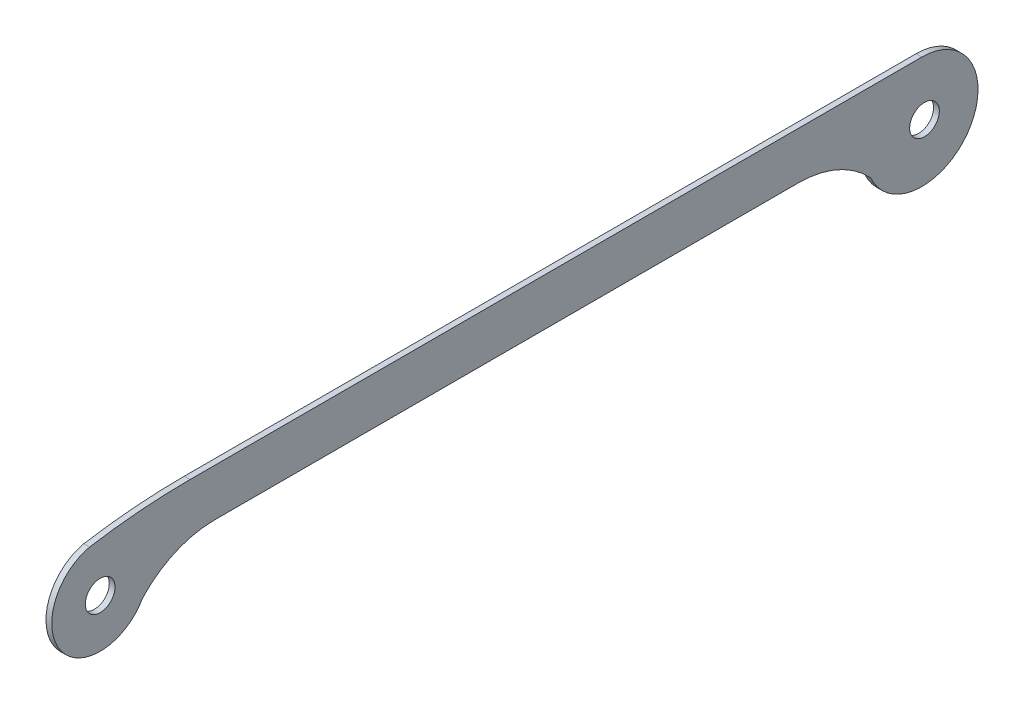
ISO-10303-21;
HEADER;
FILE_DESCRIPTION(('STEP AP214'),'2;1');
FILE_NAME('part.step','',(''),(''),'','','');
FILE_SCHEMA(('AUTOMOTIVE_DESIGN { 1 0 10303 214 1 1 1 1 }'));
ENDSEC;
DATA;
#1=APPLICATION_CONTEXT('core data for automotive mechanical design processes');
#2=APPLICATION_PROTOCOL_DEFINITION('international standard','automotive_design',2000,#1);
#3=PRODUCT_CONTEXT('',#1,'mechanical');
#4=PRODUCT('Part','Part','',(#3));
#5=PRODUCT_RELATED_PRODUCT_CATEGORY('part','',(#4));
#6=PRODUCT_DEFINITION_FORMATION('','',#4);
#7=PRODUCT_DEFINITION_CONTEXT('part definition',#1,'design');
#8=PRODUCT_DEFINITION('design','',#6,#7);
#9=PRODUCT_DEFINITION_SHAPE('','',#8);
#10=(LENGTH_UNIT() NAMED_UNIT(*) SI_UNIT(.MILLI.,.METRE.));
#11=(NAMED_UNIT(*) PLANE_ANGLE_UNIT() SI_UNIT($,.RADIAN.));
#12=(NAMED_UNIT(*) SI_UNIT($,.STERADIAN.) SOLID_ANGLE_UNIT());
#13=UNCERTAINTY_MEASURE_WITH_UNIT(LENGTH_MEASURE(1.E-05),#10,'distance_accuracy_value','');
#14=(GEOMETRIC_REPRESENTATION_CONTEXT(3) GLOBAL_UNCERTAINTY_ASSIGNED_CONTEXT((#13)) GLOBAL_UNIT_ASSIGNED_CONTEXT((#10,
#11,#12)) REPRESENTATION_CONTEXT('',''));
#15=CARTESIAN_POINT('',(0.,0.,0.));
#16=DIRECTION('',(0.,0.,1.));
#17=DIRECTION('',(1.,0.,0.));
#18=AXIS2_PLACEMENT_3D('',#15,#16,#17);
#19=CARTESIAN_POINT('',(1.5,-73.3691461799434,-93.7643002823865));
#20=DIRECTION('',(1.,0.,0.));
#21=DIRECTION('',(0.,0.,-1.));
#22=AXIS2_PLACEMENT_3D('',#19,#20,#21);
#23=PLANE('',#22);
#24=CARTESIAN_POINT('',(1.5,72.2487098482802,-70.4772250920268));
#25=DIRECTION('',(1.,0.,0.));
#26=DIRECTION('',(0.,0.,-1.));
#27=AXIS2_PLACEMENT_3D('',#24,#25,#26);
#28=CIRCLE('',#27,3.84999999998886);
#29=CARTESIAN_POINT('',(1.5,72.2487098482802,-74.3272250920156));
#30=VERTEX_POINT('',#29);
#31=EDGE_CURVE('E134',#30,#30,#28,.T.);
#32=ORIENTED_EDGE('',*,*,#31,.F.);
#33=EDGE_LOOP('',(#32));
#34=FACE_BOUND('',#33,.T.);
#35=CARTESIAN_POINT('',(1.5,-73.3691461799434,-93.7643002823865));
#36=DIRECTION('',(1.,0.,0.));
#37=DIRECTION('',(0.,0.,-1.));
#38=AXIS2_PLACEMENT_3D('',#35,#36,#37);
#39=CIRCLE('',#38,160.002122552873);
#40=CARTESIAN_POINT('',(1.5,86.6329763729295,-93.7643002823865));
#41=VERTEX_POINT('',#40);
#42=CARTESIAN_POINT('',(1.5,84.4987098480569,-67.7178177070529));
#43=VERTEX_POINT('',#42);
#44=EDGE_CURVE('E146',#41,#43,#39,.T.);
#45=ORIENTED_EDGE('',*,*,#44,.T.);
#46=CARTESIAN_POINT('',(1.5,72.2487098482802,-70.4772250920268));
#47=DIRECTION('',(1.,0.,0.));
#48=DIRECTION('',(0.,0.,-1.));
#49=AXIS2_PLACEMENT_3D('',#46,#47,#48);
#50=CIRCLE('',#49,12.556943462116);
#51=CARTESIAN_POINT('',(1.5,66.1602692163077,-81.459379697646));
#52=VERTEX_POINT('',#51);
#53=EDGE_CURVE('E90',#43,#52,#50,.T.);
#54=ORIENTED_EDGE('',*,*,#53,.T.);
#55=CARTESIAN_POINT('',(1.5,48.9111321560017,-100.201901365951));
#56=DIRECTION('',(-1.,0.,0.));
#57=DIRECTION('',(0.,0.,-1.));
#58=AXIS2_PLACEMENT_3D('',#55,#56,#57);
#59=CIRCLE('',#58,25.4718442169411);
#60=CARTESIAN_POINT('',(1.5,74.3829763729428,-100.201901365951));
#61=VERTEX_POINT('',#60);
#62=EDGE_CURVE('E161',#52,#61,#59,.T.);
#63=ORIENTED_EDGE('',*,*,#62,.T.);
#64=DIRECTION('',(0.,0.,-1.));
#65=VECTOR('',#64,1.);
#66=CARTESIAN_POINT('',(1.5,74.3829763729428,-251.501318296598));
#67=LINE('',#66,#65);
#68=CARTESIAN_POINT('',(1.5,74.3829763729428,-251.501318296598));
#69=VERTEX_POINT('',#68);
#70=EDGE_CURVE('E172',#61,#69,#67,.T.);
#71=ORIENTED_EDGE('',*,*,#70,.T.);
#72=CARTESIAN_POINT('',(1.5,48.9111321560017,-251.501318296598));
#73=DIRECTION('',(-1.,0.,0.));
#74=DIRECTION('',(0.,0.,1.));
#75=AXIS2_PLACEMENT_3D('',#72,#73,#74);
#76=CIRCLE('',#75,25.4718442169411);
#77=CARTESIAN_POINT('',(1.5,66.1602692163077,-270.243839964903));
#78=VERTEX_POINT('',#77);
#79=EDGE_CURVE('E110',#69,#78,#76,.T.);
#80=ORIENTED_EDGE('',*,*,#79,.T.);
#81=DIRECTION('',(0.,-0.735813296778874,-0.677184459570216));
#82=VECTOR('',#81,1.);
#83=CARTESIAN_POINT('',(1.5,66.1602692163077,-270.243839964903));
#84=LINE('',#83,#82);
#85=CARTESIAN_POINT('',(1.5,66.1381263311152,-270.264218528063));
#86=VERTEX_POINT('',#85);
#87=EDGE_CURVE('E103',#78,#86,#84,.T.);
#88=ORIENTED_EDGE('',*,*,#87,.T.);
#89=CARTESIAN_POINT('',(1.5,72.0776927066033,-283.55247777743));
#90=DIRECTION('',(1.,0.,0.));
#91=DIRECTION('',(0.,0.,1.));
#92=AXIS2_PLACEMENT_3D('',#89,#90,#91);
#93=CIRCLE('',#92,14.5552836663263);
#94=CARTESIAN_POINT('',(1.5,86.6329763729296,-283.55247777743));
#95=VERTEX_POINT('',#94);
#96=EDGE_CURVE('E107',#86,#95,#93,.T.);
#97=ORIENTED_EDGE('',*,*,#96,.T.);
#98=DIRECTION('',(0.,0.,1.));
#99=VECTOR('',#98,1.);
#100=CARTESIAN_POINT('',(1.5,86.6329763729296,-249.095497945172));
#101=LINE('',#100,#99);
#102=EDGE_CURVE('E49',#95,#41,#101,.T.);
#103=ORIENTED_EDGE('',*,*,#102,.T.);
#104=EDGE_LOOP('',(#45,#54,#63,#71,#80,#88,#97,#103));
#105=FACE_BOUND('',#104,.T.);
#106=CARTESIAN_POINT('',(1.5,72.2487098482802,-284.227225092027));
#107=DIRECTION('',(1.,0.,0.));
#108=DIRECTION('',(0.,0.,-1.));
#109=AXIS2_PLACEMENT_3D('',#106,#107,#108);
#110=CIRCLE('',#109,3.84999999998893);
#111=CARTESIAN_POINT('',(1.5,72.2487098482802,-288.077225092016));
#112=VERTEX_POINT('',#111);
#113=EDGE_CURVE('E181',#112,#112,#110,.T.);
#114=ORIENTED_EDGE('',*,*,#113,.F.);
#115=EDGE_LOOP('',(#114));
#116=FACE_BOUND('',#115,.T.);
#117=ADVANCED_FACE('F32',(#34,#105,#116),#23,.T.);
#118=CARTESIAN_POINT('',(0.,-73.3691461799434,-93.7643002823865));
#119=DIRECTION('',(1.,0.,0.));
#120=DIRECTION('',(0.,0.,-1.));
#121=AXIS2_PLACEMENT_3D('',#118,#119,#120);
#122=PLANE('',#121);
#123=CARTESIAN_POINT('',(0.,-73.3691461799434,-93.7643002823865));
#124=DIRECTION('',(1.,0.,0.));
#125=DIRECTION('',(0.,0.,-1.));
#126=AXIS2_PLACEMENT_3D('',#123,#124,#125);
#127=CIRCLE('',#126,160.002122552873);
#128=CARTESIAN_POINT('',(0.,86.6329763729295,-93.7643002823865));
#129=VERTEX_POINT('',#128);
#130=CARTESIAN_POINT('',(0.,84.4987098480569,-67.7178177070529));
#131=VERTEX_POINT('',#130);
#132=EDGE_CURVE('E130',#129,#131,#127,.T.);
#133=ORIENTED_EDGE('',*,*,#132,.F.);
#134=DIRECTION('',(0.,0.,1.));
#135=VECTOR('',#134,1.);
#136=CARTESIAN_POINT('',(0.,86.6329763729296,-249.095497945172));
#137=LINE('',#136,#135);
#138=CARTESIAN_POINT('',(0.,86.6329763729296,-283.55247777743));
#139=VERTEX_POINT('',#138);
#140=EDGE_CURVE('E78',#139,#129,#137,.T.);
#141=ORIENTED_EDGE('',*,*,#140,.F.);
#142=CARTESIAN_POINT('',(0.,72.0776927066033,-283.55247777743));
#143=DIRECTION('',(1.,0.,0.));
#144=DIRECTION('',(0.,0.,1.));
#145=AXIS2_PLACEMENT_3D('',#142,#143,#144);
#146=CIRCLE('',#145,14.5552836663263);
#147=CARTESIAN_POINT('',(0.,66.1381263311152,-270.264218528063));
#148=VERTEX_POINT('',#147);
#149=EDGE_CURVE('E143',#148,#139,#146,.T.);
#150=ORIENTED_EDGE('',*,*,#149,.F.);
#151=DIRECTION('',(0.,-0.735813296778874,-0.677184459570216));
#152=VECTOR('',#151,1.);
#153=CARTESIAN_POINT('',(0.,66.1602692163077,-270.243839964903));
#154=LINE('',#153,#152);
#155=CARTESIAN_POINT('',(0.,66.1602692163077,-270.243839964903));
#156=VERTEX_POINT('',#155);
#157=EDGE_CURVE('E119',#156,#148,#154,.T.);
#158=ORIENTED_EDGE('',*,*,#157,.F.);
#159=CARTESIAN_POINT('',(0.,48.9111321560017,-251.501318296598));
#160=DIRECTION('',(-1.,0.,0.));
#161=DIRECTION('',(0.,0.,1.));
#162=AXIS2_PLACEMENT_3D('',#159,#160,#161);
#163=CIRCLE('',#162,25.4718442169411);
#164=CARTESIAN_POINT('',(0.,74.3829763729428,-251.501318296598));
#165=VERTEX_POINT('',#164);
#166=EDGE_CURVE('E140',#165,#156,#163,.T.);
#167=ORIENTED_EDGE('',*,*,#166,.F.);
#168=DIRECTION('',(0.,0.,-1.));
#169=VECTOR('',#168,1.);
#170=CARTESIAN_POINT('',(0.,74.3829763729428,-251.501318296598));
#171=LINE('',#170,#169);
#172=CARTESIAN_POINT('',(0.,74.3829763729428,-100.201901365951));
#173=VERTEX_POINT('',#172);
#174=EDGE_CURVE('E138',#173,#165,#171,.T.);
#175=ORIENTED_EDGE('',*,*,#174,.F.);
#176=CARTESIAN_POINT('',(0.,48.9111321560017,-100.201901365951));
#177=DIRECTION('',(-1.,0.,0.));
#178=DIRECTION('',(0.,0.,-1.));
#179=AXIS2_PLACEMENT_3D('',#176,#177,#178);
#180=CIRCLE('',#179,25.4718442169411);
#181=CARTESIAN_POINT('',(0.,66.1602692163077,-81.459379697646));
#182=VERTEX_POINT('',#181);
#183=EDGE_CURVE('E136',#182,#173,#180,.T.);
#184=ORIENTED_EDGE('',*,*,#183,.F.);
#185=CARTESIAN_POINT('',(0.,72.2487098482802,-70.4772250920268));
#186=DIRECTION('',(1.,0.,0.));
#187=DIRECTION('',(0.,0.,-1.));
#188=AXIS2_PLACEMENT_3D('',#185,#186,#187);
#189=CIRCLE('',#188,12.556943462116);
#190=EDGE_CURVE('E133',#131,#182,#189,.T.);
#191=ORIENTED_EDGE('',*,*,#190,.F.);
#192=EDGE_LOOP('',(#133,#141,#150,#158,#167,#175,#184,#191));
#193=FACE_BOUND('',#192,.T.);
#194=CARTESIAN_POINT('',(0.,72.2487098482802,-70.4772250920268));
#195=DIRECTION('',(1.,0.,0.));
#196=DIRECTION('',(0.,0.,-1.));
#197=AXIS2_PLACEMENT_3D('',#194,#195,#196);
#198=CIRCLE('',#197,3.84999999998886);
#199=CARTESIAN_POINT('',(0.,72.2487098482802,-74.3272250920156));
#200=VERTEX_POINT('',#199);
#201=EDGE_CURVE('E178',#200,#200,#198,.T.);
#202=ORIENTED_EDGE('',*,*,#201,.T.);
#203=EDGE_LOOP('',(#202));
#204=FACE_BOUND('',#203,.T.);
#205=CARTESIAN_POINT('',(0.,72.2487098482802,-284.227225092027));
#206=DIRECTION('',(1.,0.,0.));
#207=DIRECTION('',(0.,0.,-1.));
#208=AXIS2_PLACEMENT_3D('',#205,#206,#207);
#209=CIRCLE('',#208,3.84999999998893);
#210=CARTESIAN_POINT('',(0.,72.2487098482802,-288.077225092016));
#211=VERTEX_POINT('',#210);
#212=EDGE_CURVE('E184',#211,#211,#209,.T.);
#213=ORIENTED_EDGE('',*,*,#212,.T.);
#214=EDGE_LOOP('',(#213));
#215=FACE_BOUND('',#214,.T.);
#216=ADVANCED_FACE('F163',(#193,#204,#215),#122,.F.);
#217=CARTESIAN_POINT('',(1.5,-73.3691461799434,-93.7643002823865));
#218=DIRECTION('',(-1.,0.,0.));
#219=DIRECTION('',(0.,0.,1.));
#220=AXIS2_PLACEMENT_3D('',#217,#218,#219);
#221=CYLINDRICAL_SURFACE('',#220,160.002122552873);
#222=ORIENTED_EDGE('',*,*,#132,.T.);
#223=DIRECTION('',(-1.,0.,0.));
#224=VECTOR('',#223,1.);
#225=CARTESIAN_POINT('',(1.5,84.4987098480569,-67.7178177070529));
#226=LINE('',#225,#224);
#227=EDGE_CURVE('E11',#43,#131,#226,.T.);
#228=ORIENTED_EDGE('',*,*,#227,.F.);
#229=ORIENTED_EDGE('',*,*,#44,.F.);
#230=DIRECTION('',(-1.,0.,0.));
#231=VECTOR('',#230,1.);
#232=CARTESIAN_POINT('',(1.5,86.6329763729295,-93.7643002823865));
#233=LINE('',#232,#231);
#234=EDGE_CURVE('E126',#41,#129,#233,.T.);
#235=ORIENTED_EDGE('',*,*,#234,.T.);
#236=EDGE_LOOP('',(#222,#228,#229,#235));
#237=FACE_BOUND('',#236,.T.);
#238=ADVANCED_FACE('F34',(#237),#221,.T.);
#239=CARTESIAN_POINT('',(1.5,72.2487098482802,-70.4772250920268));
#240=DIRECTION('',(-1.,0.,0.));
#241=DIRECTION('',(0.,0.,1.));
#242=AXIS2_PLACEMENT_3D('',#239,#240,#241);
#243=CYLINDRICAL_SURFACE('',#242,12.556943462116);
#244=ORIENTED_EDGE('',*,*,#190,.T.);
#245=DIRECTION('',(-1.,0.,0.));
#246=VECTOR('',#245,1.);
#247=CARTESIAN_POINT('',(1.5,66.1602692163077,-81.459379697646));
#248=LINE('',#247,#246);
#249=EDGE_CURVE('E41',#52,#182,#248,.T.);
#250=ORIENTED_EDGE('',*,*,#249,.F.);
#251=ORIENTED_EDGE('',*,*,#53,.F.);
#252=ORIENTED_EDGE('',*,*,#227,.T.);
#253=EDGE_LOOP('',(#244,#250,#251,#252));
#254=FACE_BOUND('',#253,.T.);
#255=ADVANCED_FACE('F216',(#254),#243,.T.);
#256=CARTESIAN_POINT('',(1.5,48.9111321560017,-100.201901365951));
#257=DIRECTION('',(-1.,0.,0.));
#258=DIRECTION('',(0.,0.,1.));
#259=AXIS2_PLACEMENT_3D('',#256,#257,#258);
#260=CYLINDRICAL_SURFACE('',#259,25.4718442169411);
#261=ORIENTED_EDGE('',*,*,#183,.T.);
#262=DIRECTION('',(-1.,0.,0.));
#263=VECTOR('',#262,1.);
#264=CARTESIAN_POINT('',(1.5,74.3829763729428,-100.201901365951));
#265=LINE('',#264,#263);
#266=EDGE_CURVE('E153',#61,#173,#265,.T.);
#267=ORIENTED_EDGE('',*,*,#266,.F.);
#268=ORIENTED_EDGE('',*,*,#62,.F.);
#269=ORIENTED_EDGE('',*,*,#249,.T.);
#270=EDGE_LOOP('',(#261,#267,#268,#269));
#271=FACE_BOUND('',#270,.T.);
#272=ADVANCED_FACE('F159',(#271),#260,.F.);
#273=CARTESIAN_POINT('',(1.5,74.3829763729428,-251.501318296598));
#274=DIRECTION('',(0.,1.,0.));
#275=DIRECTION('',(0.,0.,1.));
#276=AXIS2_PLACEMENT_3D('',#273,#274,#275);
#277=PLANE('',#276);
#278=ORIENTED_EDGE('',*,*,#174,.T.);
#279=DIRECTION('',(-1.,0.,0.));
#280=VECTOR('',#279,1.);
#281=CARTESIAN_POINT('',(1.5,74.3829763729428,-251.501318296598));
#282=LINE('',#281,#280);
#283=EDGE_CURVE('E150',#69,#165,#282,.T.);
#284=ORIENTED_EDGE('',*,*,#283,.F.);
#285=ORIENTED_EDGE('',*,*,#70,.F.);
#286=ORIENTED_EDGE('',*,*,#266,.T.);
#287=EDGE_LOOP('',(#278,#284,#285,#286));
#288=FACE_BOUND('',#287,.T.);
#289=ADVANCED_FACE('F168',(#288),#277,.F.);
#290=CARTESIAN_POINT('',(1.5,48.9111321560017,-251.501318296598));
#291=DIRECTION('',(-1.,0.,0.));
#292=DIRECTION('',(0.,0.,1.));
#293=AXIS2_PLACEMENT_3D('',#290,#291,#292);
#294=CYLINDRICAL_SURFACE('',#293,25.4718442169411);
#295=ORIENTED_EDGE('',*,*,#166,.T.);
#296=DIRECTION('',(-1.,0.,0.));
#297=VECTOR('',#296,1.);
#298=CARTESIAN_POINT('',(1.5,66.1602692163077,-270.243839964903));
#299=LINE('',#298,#297);
#300=EDGE_CURVE('E121',#78,#156,#299,.T.);
#301=ORIENTED_EDGE('',*,*,#300,.F.);
#302=ORIENTED_EDGE('',*,*,#79,.F.);
#303=ORIENTED_EDGE('',*,*,#283,.T.);
#304=EDGE_LOOP('',(#295,#301,#302,#303));
#305=FACE_BOUND('',#304,.T.);
#306=ADVANCED_FACE('F171',(#305),#294,.F.);
#307=CARTESIAN_POINT('',(1.5,66.1602692163077,-270.243839964903));
#308=DIRECTION('',(0.,0.677184459570216,-0.735813296778874));
#309=DIRECTION('',(0.,0.735813296778874,0.677184459570216));
#310=AXIS2_PLACEMENT_3D('',#307,#308,#309);
#311=PLANE('',#310);
#312=ORIENTED_EDGE('',*,*,#157,.T.);
#313=DIRECTION('',(-1.,0.,0.));
#314=VECTOR('',#313,1.);
#315=CARTESIAN_POINT('',(1.5,66.1381263311152,-270.264218528063));
#316=LINE('',#315,#314);
#317=EDGE_CURVE('E116',#86,#148,#316,.T.);
#318=ORIENTED_EDGE('',*,*,#317,.F.);
#319=ORIENTED_EDGE('',*,*,#87,.F.);
#320=ORIENTED_EDGE('',*,*,#300,.T.);
#321=EDGE_LOOP('',(#312,#318,#319,#320));
#322=FACE_BOUND('',#321,.T.);
#323=ADVANCED_FACE('F117',(#322),#311,.F.);
#324=CARTESIAN_POINT('',(1.5,72.0776927066033,-283.55247777743));
#325=DIRECTION('',(-1.,0.,0.));
#326=DIRECTION('',(0.,0.,1.));
#327=AXIS2_PLACEMENT_3D('',#324,#325,#326);
#328=CYLINDRICAL_SURFACE('',#327,14.5552836663263);
#329=ORIENTED_EDGE('',*,*,#149,.T.);
#330=DIRECTION('',(-1.,0.,0.));
#331=VECTOR('',#330,1.);
#332=CARTESIAN_POINT('',(1.5,86.6329763729296,-283.55247777743));
#333=LINE('',#332,#331);
#334=EDGE_CURVE('E122',#95,#139,#333,.T.);
#335=ORIENTED_EDGE('',*,*,#334,.F.);
#336=ORIENTED_EDGE('',*,*,#96,.F.);
#337=ORIENTED_EDGE('',*,*,#317,.T.);
#338=EDGE_LOOP('',(#329,#335,#336,#337));
#339=FACE_BOUND('',#338,.T.);
#340=ADVANCED_FACE('F124',(#339),#328,.T.);
#341=CARTESIAN_POINT('',(1.5,86.6329763729296,-249.095497945172));
#342=DIRECTION('',(0.,-1.,0.));
#343=DIRECTION('',(0.,0.,-1.));
#344=AXIS2_PLACEMENT_3D('',#341,#342,#343);
#345=PLANE('',#344);
#346=ORIENTED_EDGE('',*,*,#140,.T.);
#347=ORIENTED_EDGE('',*,*,#234,.F.);
#348=ORIENTED_EDGE('',*,*,#102,.F.);
#349=ORIENTED_EDGE('',*,*,#334,.T.);
#350=EDGE_LOOP('',(#346,#347,#348,#349));
#351=FACE_BOUND('',#350,.T.);
#352=ADVANCED_FACE('F204',(#351),#345,.F.);
#353=CARTESIAN_POINT('',(1.5,72.2487098482802,-70.4772250920268));
#354=DIRECTION('',(-1.,0.,0.));
#355=DIRECTION('',(0.,0.,1.));
#356=AXIS2_PLACEMENT_3D('',#353,#354,#355);
#357=CYLINDRICAL_SURFACE('',#356,3.84999999998886);
#358=ORIENTED_EDGE('',*,*,#31,.T.);
#359=EDGE_LOOP('',(#358));
#360=FACE_BOUND('',#359,.T.);
#361=ORIENTED_EDGE('',*,*,#201,.F.);
#362=EDGE_LOOP('',(#361));
#363=FACE_BOUND('',#362,.T.);
#364=ADVANCED_FACE('F201',(#360,#363),#357,.F.);
#365=CARTESIAN_POINT('',(1.5,72.2487098482802,-284.227225092027));
#366=DIRECTION('',(-1.,0.,0.));
#367=DIRECTION('',(0.,0.,1.));
#368=AXIS2_PLACEMENT_3D('',#365,#366,#367);
#369=CYLINDRICAL_SURFACE('',#368,3.84999999998893);
#370=ORIENTED_EDGE('',*,*,#113,.T.);
#371=EDGE_LOOP('',(#370));
#372=FACE_BOUND('',#371,.T.);
#373=ORIENTED_EDGE('',*,*,#212,.F.);
#374=EDGE_LOOP('',(#373));
#375=FACE_BOUND('',#374,.T.);
#376=ADVANCED_FACE('F190',(#372,#375),#369,.F.);
#377=CLOSED_SHELL('',(#117,#216,#238,#255,#272,#289,#306,#323,#340,#352,#364,#376));
#378=MANIFOLD_SOLID_BREP('B2',#377);
#379=ADVANCED_BREP_SHAPE_REPRESENTATION('',(#18,#378),#14);
#380=SHAPE_DEFINITION_REPRESENTATION(#9,#379);
ENDSEC;
END-ISO-10303-21;
